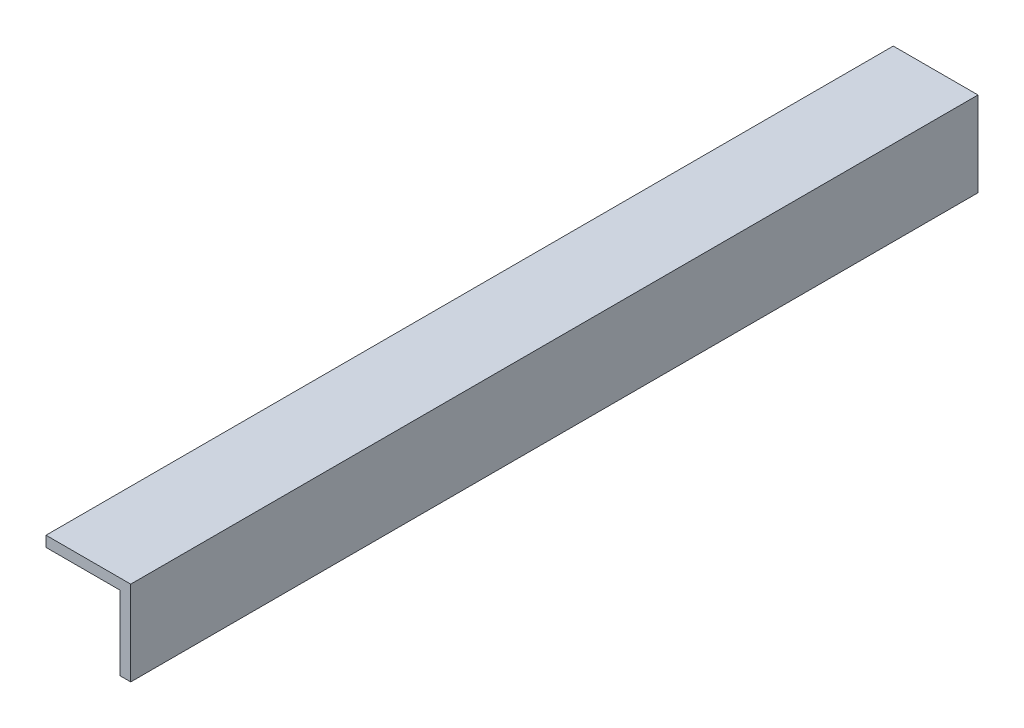
ISO-10303-21;
HEADER;
FILE_DESCRIPTION(('STEP AP214'),'2;1');
FILE_NAME('part.step','',(''),(''),'','','');
FILE_SCHEMA(('AUTOMOTIVE_DESIGN { 1 0 10303 214 1 1 1 1 }'));
ENDSEC;
DATA;
#1=APPLICATION_CONTEXT('core data for automotive mechanical design processes');
#2=APPLICATION_PROTOCOL_DEFINITION('international standard','automotive_design',2000,#1);
#3=PRODUCT_CONTEXT('',#1,'mechanical');
#4=PRODUCT('Part','Part','',(#3));
#5=PRODUCT_RELATED_PRODUCT_CATEGORY('part','',(#4));
#6=PRODUCT_DEFINITION_FORMATION('','',#4);
#7=PRODUCT_DEFINITION_CONTEXT('part definition',#1,'design');
#8=PRODUCT_DEFINITION('design','',#6,#7);
#9=PRODUCT_DEFINITION_SHAPE('','',#8);
#10=(LENGTH_UNIT() NAMED_UNIT(*) SI_UNIT(.MILLI.,.METRE.));
#11=(NAMED_UNIT(*) PLANE_ANGLE_UNIT() SI_UNIT($,.RADIAN.));
#12=(NAMED_UNIT(*) SI_UNIT($,.STERADIAN.) SOLID_ANGLE_UNIT());
#13=UNCERTAINTY_MEASURE_WITH_UNIT(LENGTH_MEASURE(1.E-05),#10,'distance_accuracy_value','');
#14=(GEOMETRIC_REPRESENTATION_CONTEXT(3) GLOBAL_UNCERTAINTY_ASSIGNED_CONTEXT((#13)) GLOBAL_UNIT_ASSIGNED_CONTEXT((#10,
#11,#12)) REPRESENTATION_CONTEXT('',''));
#15=CARTESIAN_POINT('',(0.,0.,0.));
#16=DIRECTION('',(0.,0.,1.));
#17=DIRECTION('',(1.,0.,0.));
#18=AXIS2_PLACEMENT_3D('',#15,#16,#17);
#19=CARTESIAN_POINT('',(-23.485864358239,12.7,254.));
#20=DIRECTION('',(0.,-1.,0.));
#21=DIRECTION('',(0.,0.,-1.));
#22=AXIS2_PLACEMENT_3D('',#19,#20,#21);
#23=PLANE('',#22);
#24=DIRECTION('',(-1.,0.,0.));
#25=VECTOR('',#24,1.);
#26=CARTESIAN_POINT('',(-23.485864358239,12.7,0.));
#27=LINE('',#26,#25);
#28=CARTESIAN_POINT('',(1.91413564176102,12.7,0.));
#29=VERTEX_POINT('',#28);
#30=CARTESIAN_POINT('',(-23.485864358239,12.7,0.));
#31=VERTEX_POINT('',#30);
#32=EDGE_CURVE('E123',#29,#31,#27,.T.);
#33=ORIENTED_EDGE('',*,*,#32,.T.);
#34=DIRECTION('',(0.,0.,-1.));
#35=VECTOR('',#34,1.);
#36=CARTESIAN_POINT('',(-23.485864358239,12.7,254.));
#37=LINE('',#36,#35);
#38=CARTESIAN_POINT('',(-23.485864358239,12.7,254.));
#39=VERTEX_POINT('',#38);
#40=EDGE_CURVE('E11',#39,#31,#37,.T.);
#41=ORIENTED_EDGE('',*,*,#40,.F.);
#42=DIRECTION('',(-1.,0.,0.));
#43=VECTOR('',#42,1.);
#44=CARTESIAN_POINT('',(-23.485864358239,12.7,254.));
#45=LINE('',#44,#43);
#46=CARTESIAN_POINT('',(1.91413564176102,12.7,254.));
#47=VERTEX_POINT('',#46);
#48=EDGE_CURVE('E133',#47,#39,#45,.T.);
#49=ORIENTED_EDGE('',*,*,#48,.F.);
#50=DIRECTION('',(0.,0.,-1.));
#51=VECTOR('',#50,1.);
#52=CARTESIAN_POINT('',(1.91413564176102,12.7,254.));
#53=LINE('',#52,#51);
#54=EDGE_CURVE('E119',#47,#29,#53,.T.);
#55=ORIENTED_EDGE('',*,*,#54,.T.);
#56=EDGE_LOOP('',(#33,#41,#49,#55));
#57=FACE_BOUND('',#56,.T.);
#58=ADVANCED_FACE('F39',(#57),#23,.F.);
#59=CARTESIAN_POINT('',(-23.485864358239,9.525,254.));
#60=DIRECTION('',(1.,0.,0.));
#61=DIRECTION('',(0.,0.,-1.));
#62=AXIS2_PLACEMENT_3D('',#59,#60,#61);
#63=PLANE('',#62);
#64=DIRECTION('',(0.,-1.,0.));
#65=VECTOR('',#64,1.);
#66=CARTESIAN_POINT('',(-23.485864358239,9.525,0.));
#67=LINE('',#66,#65);
#68=CARTESIAN_POINT('',(-23.485864358239,9.525,0.));
#69=VERTEX_POINT('',#68);
#70=EDGE_CURVE('E126',#31,#69,#67,.T.);
#71=ORIENTED_EDGE('',*,*,#70,.T.);
#72=DIRECTION('',(0.,0.,-1.));
#73=VECTOR('',#72,1.);
#74=CARTESIAN_POINT('',(-23.485864358239,9.525,254.));
#75=LINE('',#74,#73);
#76=CARTESIAN_POINT('',(-23.485864358239,9.525,254.));
#77=VERTEX_POINT('',#76);
#78=EDGE_CURVE('E47',#77,#69,#75,.T.);
#79=ORIENTED_EDGE('',*,*,#78,.F.);
#80=DIRECTION('',(0.,-1.,0.));
#81=VECTOR('',#80,1.);
#82=CARTESIAN_POINT('',(-23.485864358239,9.525,254.));
#83=LINE('',#82,#81);
#84=EDGE_CURVE('E92',#39,#77,#83,.T.);
#85=ORIENTED_EDGE('',*,*,#84,.F.);
#86=ORIENTED_EDGE('',*,*,#40,.T.);
#87=EDGE_LOOP('',(#71,#79,#85,#86));
#88=FACE_BOUND('',#87,.T.);
#89=ADVANCED_FACE('F157',(#88),#63,.F.);
#90=CARTESIAN_POINT('',(-1.26086435823898,9.525,254.));
#91=DIRECTION('',(0.,1.,0.));
#92=DIRECTION('',(0.,0.,1.));
#93=AXIS2_PLACEMENT_3D('',#90,#91,#92);
#94=PLANE('',#93);
#95=DIRECTION('',(1.,0.,0.));
#96=VECTOR('',#95,1.);
#97=CARTESIAN_POINT('',(-1.26086435823898,9.525,0.));
#98=LINE('',#97,#96);
#99=CARTESIAN_POINT('',(-1.26086435823898,9.525,0.));
#100=VERTEX_POINT('',#99);
#101=EDGE_CURVE('E128',#69,#100,#98,.T.);
#102=ORIENTED_EDGE('',*,*,#101,.T.);
#103=DIRECTION('',(0.,0.,-1.));
#104=VECTOR('',#103,1.);
#105=CARTESIAN_POINT('',(-1.26086435823898,9.525,254.));
#106=LINE('',#105,#104);
#107=CARTESIAN_POINT('',(-1.26086435823898,9.525,254.));
#108=VERTEX_POINT('',#107);
#109=EDGE_CURVE('E114',#108,#100,#106,.T.);
#110=ORIENTED_EDGE('',*,*,#109,.F.);
#111=DIRECTION('',(1.,0.,0.));
#112=VECTOR('',#111,1.);
#113=CARTESIAN_POINT('',(-1.26086435823898,9.525,254.));
#114=LINE('',#113,#112);
#115=EDGE_CURVE('E105',#77,#108,#114,.T.);
#116=ORIENTED_EDGE('',*,*,#115,.F.);
#117=ORIENTED_EDGE('',*,*,#78,.T.);
#118=EDGE_LOOP('',(#102,#110,#116,#117));
#119=FACE_BOUND('',#118,.T.);
#120=ADVANCED_FACE('F139',(#119),#94,.F.);
#121=CARTESIAN_POINT('',(-1.26086435823898,-12.7,254.));
#122=DIRECTION('',(1.,0.,0.));
#123=DIRECTION('',(0.,1.,0.));
#124=AXIS2_PLACEMENT_3D('',#121,#122,#123);
#125=PLANE('',#124);
#126=DIRECTION('',(0.,-1.,0.));
#127=VECTOR('',#126,1.);
#128=CARTESIAN_POINT('',(-1.26086435823898,-12.7,0.));
#129=LINE('',#128,#127);
#130=CARTESIAN_POINT('',(-1.26086435823898,-12.7,0.));
#131=VERTEX_POINT('',#130);
#132=EDGE_CURVE('E113',#100,#131,#129,.T.);
#133=ORIENTED_EDGE('',*,*,#132,.T.);
#134=DIRECTION('',(0.,0.,-1.));
#135=VECTOR('',#134,1.);
#136=CARTESIAN_POINT('',(-1.26086435823898,-12.7,254.));
#137=LINE('',#136,#135);
#138=CARTESIAN_POINT('',(-1.26086435823898,-12.7,254.));
#139=VERTEX_POINT('',#138);
#140=EDGE_CURVE('E110',#139,#131,#137,.T.);
#141=ORIENTED_EDGE('',*,*,#140,.F.);
#142=DIRECTION('',(0.,-1.,0.));
#143=VECTOR('',#142,1.);
#144=CARTESIAN_POINT('',(-1.26086435823898,-12.7,254.));
#145=LINE('',#144,#143);
#146=EDGE_CURVE('E99',#108,#139,#145,.T.);
#147=ORIENTED_EDGE('',*,*,#146,.F.);
#148=ORIENTED_EDGE('',*,*,#109,.T.);
#149=EDGE_LOOP('',(#133,#141,#147,#148));
#150=FACE_BOUND('',#149,.T.);
#151=ADVANCED_FACE('F111',(#150),#125,.F.);
#152=CARTESIAN_POINT('',(1.91413564176102,-12.7,254.));
#153=DIRECTION('',(0.,1.,0.));
#154=DIRECTION('',(0.,0.,1.));
#155=AXIS2_PLACEMENT_3D('',#152,#153,#154);
#156=PLANE('',#155);
#157=DIRECTION('',(1.,0.,0.));
#158=VECTOR('',#157,1.);
#159=CARTESIAN_POINT('',(1.91413564176102,-12.7,0.));
#160=LINE('',#159,#158);
#161=CARTESIAN_POINT('',(1.91413564176102,-12.7,0.));
#162=VERTEX_POINT('',#161);
#163=EDGE_CURVE('E78',#131,#162,#160,.T.);
#164=ORIENTED_EDGE('',*,*,#163,.T.);
#165=DIRECTION('',(0.,0.,-1.));
#166=VECTOR('',#165,1.);
#167=CARTESIAN_POINT('',(1.91413564176102,-12.7,254.));
#168=LINE('',#167,#166);
#169=CARTESIAN_POINT('',(1.91413564176102,-12.7,254.));
#170=VERTEX_POINT('',#169);
#171=EDGE_CURVE('E115',#170,#162,#168,.T.);
#172=ORIENTED_EDGE('',*,*,#171,.F.);
#173=DIRECTION('',(1.,0.,0.));
#174=VECTOR('',#173,1.);
#175=CARTESIAN_POINT('',(1.91413564176102,-12.7,254.));
#176=LINE('',#175,#174);
#177=EDGE_CURVE('E103',#139,#170,#176,.T.);
#178=ORIENTED_EDGE('',*,*,#177,.F.);
#179=ORIENTED_EDGE('',*,*,#140,.T.);
#180=EDGE_LOOP('',(#164,#172,#178,#179));
#181=FACE_BOUND('',#180,.T.);
#182=ADVANCED_FACE('F117',(#181),#156,.F.);
#183=CARTESIAN_POINT('',(1.91413564176102,12.7,254.));
#184=DIRECTION('',(-1.,0.,0.));
#185=DIRECTION('',(0.,-1.,0.));
#186=AXIS2_PLACEMENT_3D('',#183,#184,#185);
#187=PLANE('',#186);
#188=DIRECTION('',(0.,1.,0.));
#189=VECTOR('',#188,1.);
#190=CARTESIAN_POINT('',(1.91413564176102,12.7,0.));
#191=LINE('',#190,#189);
#192=EDGE_CURVE('E84',#162,#29,#191,.T.);
#193=ORIENTED_EDGE('',*,*,#192,.T.);
#194=ORIENTED_EDGE('',*,*,#54,.F.);
#195=DIRECTION('',(0.,1.,0.));
#196=VECTOR('',#195,1.);
#197=CARTESIAN_POINT('',(1.91413564176102,12.7,254.));
#198=LINE('',#197,#196);
#199=EDGE_CURVE('E55',#170,#47,#198,.T.);
#200=ORIENTED_EDGE('',*,*,#199,.F.);
#201=ORIENTED_EDGE('',*,*,#171,.T.);
#202=EDGE_LOOP('',(#193,#194,#200,#201));
#203=FACE_BOUND('',#202,.T.);
#204=ADVANCED_FACE('F146',(#203),#187,.F.);
#205=CARTESIAN_POINT('',(0.,0.,254.));
#206=DIRECTION('',(0.,0.,-1.));
#207=DIRECTION('',(-1.,0.,0.));
#208=AXIS2_PLACEMENT_3D('',#205,#206,#207);
#209=PLANE('',#208);
#210=ORIENTED_EDGE('',*,*,#48,.T.);
#211=ORIENTED_EDGE('',*,*,#84,.T.);
#212=ORIENTED_EDGE('',*,*,#115,.T.);
#213=ORIENTED_EDGE('',*,*,#146,.T.);
#214=ORIENTED_EDGE('',*,*,#177,.T.);
#215=ORIENTED_EDGE('',*,*,#199,.T.);
#216=EDGE_LOOP('',(#210,#211,#212,#213,#214,#215));
#217=FACE_BOUND('',#216,.T.);
#218=ADVANCED_FACE('F101',(#217),#209,.F.);
#219=CARTESIAN_POINT('',(0.,0.,0.));
#220=DIRECTION('',(0.,0.,-1.));
#221=DIRECTION('',(-1.,0.,0.));
#222=AXIS2_PLACEMENT_3D('',#219,#220,#221);
#223=PLANE('',#222);
#224=ORIENTED_EDGE('',*,*,#32,.F.);
#225=ORIENTED_EDGE('',*,*,#192,.F.);
#226=ORIENTED_EDGE('',*,*,#163,.F.);
#227=ORIENTED_EDGE('',*,*,#132,.F.);
#228=ORIENTED_EDGE('',*,*,#101,.F.);
#229=ORIENTED_EDGE('',*,*,#70,.F.);
#230=EDGE_LOOP('',(#224,#225,#226,#227,#228,#229));
#231=FACE_BOUND('',#230,.T.);
#232=ADVANCED_FACE('F142',(#231),#223,.T.);
#233=CLOSED_SHELL('',(#58,#89,#120,#151,#182,#204,#218,#232));
#234=MANIFOLD_SOLID_BREP('B2',#233);
#235=ADVANCED_BREP_SHAPE_REPRESENTATION('',(#18,#234),#14);
#236=SHAPE_DEFINITION_REPRESENTATION(#9,#235);
ENDSEC;
END-ISO-10303-21;
